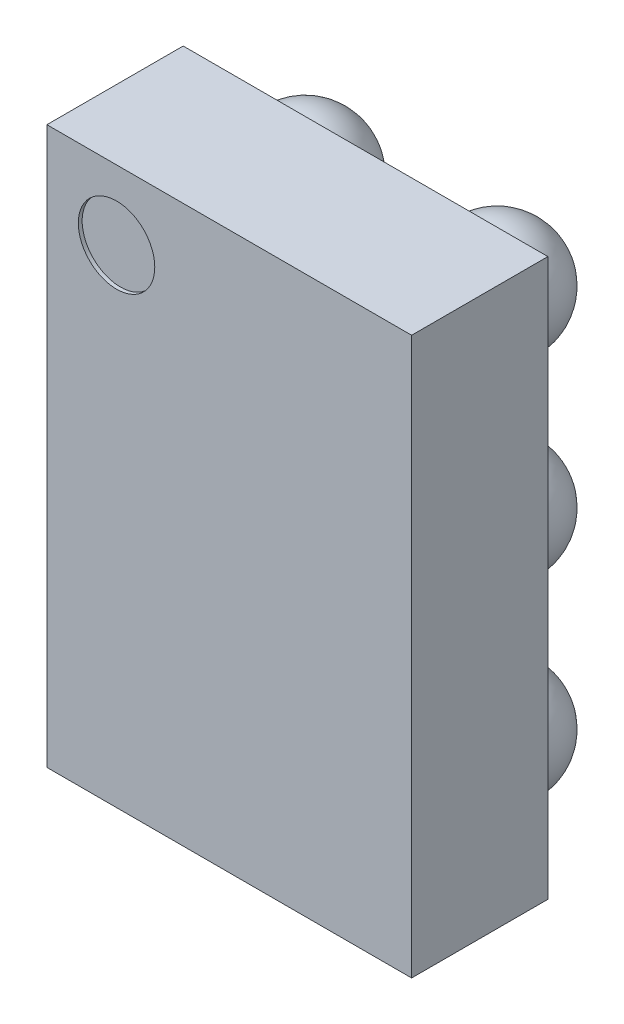
ISO-10303-21;
HEADER;
FILE_DESCRIPTION(('STEP AP214'),'2;1');
FILE_NAME('part.step','',(''),(''),'','','');
FILE_SCHEMA(('AUTOMOTIVE_DESIGN { 1 0 10303 214 1 1 1 1 }'));
ENDSEC;
DATA;
#1=APPLICATION_CONTEXT('core data for automotive mechanical design processes');
#2=APPLICATION_PROTOCOL_DEFINITION('international standard','automotive_design',2000,#1);
#3=PRODUCT_CONTEXT('',#1,'mechanical');
#4=PRODUCT('Part','Part','',(#3));
#5=PRODUCT_RELATED_PRODUCT_CATEGORY('part','',(#4));
#6=PRODUCT_DEFINITION_FORMATION('','',#4);
#7=PRODUCT_DEFINITION_CONTEXT('part definition',#1,'design');
#8=PRODUCT_DEFINITION('design','',#6,#7);
#9=PRODUCT_DEFINITION_SHAPE('','',#8);
#10=(LENGTH_UNIT() NAMED_UNIT(*) SI_UNIT(.MILLI.,.METRE.));
#11=(NAMED_UNIT(*) PLANE_ANGLE_UNIT() SI_UNIT($,.RADIAN.));
#12=(NAMED_UNIT(*) SI_UNIT($,.STERADIAN.) SOLID_ANGLE_UNIT());
#13=UNCERTAINTY_MEASURE_WITH_UNIT(LENGTH_MEASURE(1.E-05),#10,'distance_accuracy_value','');
#14=(GEOMETRIC_REPRESENTATION_CONTEXT(3) GLOBAL_UNCERTAINTY_ASSIGNED_CONTEXT((#13)) GLOBAL_UNIT_ASSIGNED_CONTEXT((#10,
#11,#12)) REPRESENTATION_CONTEXT('',''));
#15=CARTESIAN_POINT('',(0.,0.,0.));
#16=DIRECTION('',(0.,0.,1.));
#17=DIRECTION('',(1.,0.,0.));
#18=AXIS2_PLACEMENT_3D('',#15,#16,#17);
#19=CARTESIAN_POINT('',(0.475,-0.725,0.595));
#20=DIRECTION('',(-1.,0.,0.));
#21=DIRECTION('',(0.,0.,1.));
#22=AXIS2_PLACEMENT_3D('',#19,#20,#21);
#23=PLANE('',#22);
#24=DIRECTION('',(0.,1.,0.));
#25=VECTOR('',#24,1.);
#26=CARTESIAN_POINT('',(0.475,-0.725,0.24));
#27=LINE('',#26,#25);
#28=CARTESIAN_POINT('',(0.475,-0.725,0.24));
#29=VERTEX_POINT('',#28);
#30=CARTESIAN_POINT('',(0.475,0.725,0.24));
#31=VERTEX_POINT('',#30);
#32=EDGE_CURVE('E114',#29,#31,#27,.T.);
#33=ORIENTED_EDGE('',*,*,#32,.T.);
#34=DIRECTION('',(0.,0.,-1.));
#35=VECTOR('',#34,1.);
#36=CARTESIAN_POINT('',(0.475,0.725,0.595));
#37=LINE('',#36,#35);
#38=CARTESIAN_POINT('',(0.475,0.725,0.595));
#39=VERTEX_POINT('',#38);
#40=EDGE_CURVE('E103',#39,#31,#37,.T.);
#41=ORIENTED_EDGE('',*,*,#40,.F.);
#42=DIRECTION('',(0.,1.,0.));
#43=VECTOR('',#42,1.);
#44=CARTESIAN_POINT('',(0.475,-0.725,0.595));
#45=LINE('',#44,#43);
#46=CARTESIAN_POINT('',(0.475,-0.725,0.595));
#47=VERTEX_POINT('',#46);
#48=EDGE_CURVE('E95',#47,#39,#45,.T.);
#49=ORIENTED_EDGE('',*,*,#48,.F.);
#50=DIRECTION('',(0.,0.,-1.));
#51=VECTOR('',#50,1.);
#52=CARTESIAN_POINT('',(0.475,-0.725,0.595));
#53=LINE('',#52,#51);
#54=EDGE_CURVE('E110',#47,#29,#53,.T.);
#55=ORIENTED_EDGE('',*,*,#54,.T.);
#56=EDGE_LOOP('',(#33,#41,#49,#55));
#57=FACE_BOUND('',#56,.T.);
#58=ADVANCED_FACE('F42',(#57),#23,.F.);
#59=CARTESIAN_POINT('',(-0.475,0.725,0.595));
#60=DIRECTION('',(0.,-1.,0.));
#61=DIRECTION('',(0.,0.,-1.));
#62=AXIS2_PLACEMENT_3D('',#59,#60,#61);
#63=PLANE('',#62);
#64=DIRECTION('',(-1.,0.,0.));
#65=VECTOR('',#64,1.);
#66=CARTESIAN_POINT('',(-0.475,0.725,0.24));
#67=LINE('',#66,#65);
#68=CARTESIAN_POINT('',(-0.475,0.725,0.24));
#69=VERTEX_POINT('',#68);
#70=EDGE_CURVE('E101',#31,#69,#67,.T.);
#71=ORIENTED_EDGE('',*,*,#70,.T.);
#72=DIRECTION('',(0.,0.,-1.));
#73=VECTOR('',#72,1.);
#74=CARTESIAN_POINT('',(-0.475,0.725,0.595));
#75=LINE('',#74,#73);
#76=CARTESIAN_POINT('',(-0.475,0.725,0.595));
#77=VERTEX_POINT('',#76);
#78=EDGE_CURVE('E99',#77,#69,#75,.T.);
#79=ORIENTED_EDGE('',*,*,#78,.F.);
#80=DIRECTION('',(-1.,0.,0.));
#81=VECTOR('',#80,1.);
#82=CARTESIAN_POINT('',(-0.475,0.725,0.595));
#83=LINE('',#82,#81);
#84=EDGE_CURVE('E90',#39,#77,#83,.T.);
#85=ORIENTED_EDGE('',*,*,#84,.F.);
#86=ORIENTED_EDGE('',*,*,#40,.T.);
#87=EDGE_LOOP('',(#71,#79,#85,#86));
#88=FACE_BOUND('',#87,.T.);
#89=ADVANCED_FACE('F100',(#88),#63,.F.);
#90=CARTESIAN_POINT('',(-0.475,-0.725,0.595));
#91=DIRECTION('',(1.,0.,0.));
#92=DIRECTION('',(0.,0.,-1.));
#93=AXIS2_PLACEMENT_3D('',#90,#91,#92);
#94=PLANE('',#93);
#95=DIRECTION('',(0.,-1.,0.));
#96=VECTOR('',#95,1.);
#97=CARTESIAN_POINT('',(-0.475,-0.725,0.24));
#98=LINE('',#97,#96);
#99=CARTESIAN_POINT('',(-0.475,-0.725,0.24));
#100=VERTEX_POINT('',#99);
#101=EDGE_CURVE('E76',#69,#100,#98,.T.);
#102=ORIENTED_EDGE('',*,*,#101,.T.);
#103=DIRECTION('',(0.,0.,-1.));
#104=VECTOR('',#103,1.);
#105=CARTESIAN_POINT('',(-0.475,-0.725,0.595));
#106=LINE('',#105,#104);
#107=CARTESIAN_POINT('',(-0.475,-0.725,0.595));
#108=VERTEX_POINT('',#107);
#109=EDGE_CURVE('E104',#108,#100,#106,.T.);
#110=ORIENTED_EDGE('',*,*,#109,.F.);
#111=DIRECTION('',(0.,-1.,0.));
#112=VECTOR('',#111,1.);
#113=CARTESIAN_POINT('',(-0.475,-0.725,0.595));
#114=LINE('',#113,#112);
#115=EDGE_CURVE('E93',#77,#108,#114,.T.);
#116=ORIENTED_EDGE('',*,*,#115,.F.);
#117=ORIENTED_EDGE('',*,*,#78,.T.);
#118=EDGE_LOOP('',(#102,#110,#116,#117));
#119=FACE_BOUND('',#118,.T.);
#120=ADVANCED_FACE('F106',(#119),#94,.F.);
#121=CARTESIAN_POINT('',(-0.475,-0.725,0.595));
#122=DIRECTION('',(0.,1.,0.));
#123=DIRECTION('',(0.,0.,1.));
#124=AXIS2_PLACEMENT_3D('',#121,#122,#123);
#125=PLANE('',#124);
#126=DIRECTION('',(1.,0.,0.));
#127=VECTOR('',#126,1.);
#128=CARTESIAN_POINT('',(-0.475,-0.725,0.24));
#129=LINE('',#128,#127);
#130=EDGE_CURVE('E82',#100,#29,#129,.T.);
#131=ORIENTED_EDGE('',*,*,#130,.T.);
#132=ORIENTED_EDGE('',*,*,#54,.F.);
#133=DIRECTION('',(1.,0.,0.));
#134=VECTOR('',#133,1.);
#135=CARTESIAN_POINT('',(-0.475,-0.725,0.595));
#136=LINE('',#135,#134);
#137=EDGE_CURVE('E59',#108,#47,#136,.T.);
#138=ORIENTED_EDGE('',*,*,#137,.F.);
#139=ORIENTED_EDGE('',*,*,#109,.T.);
#140=EDGE_LOOP('',(#131,#132,#138,#139));
#141=FACE_BOUND('',#140,.T.);
#142=ADVANCED_FACE('F168',(#141),#125,.F.);
#143=CARTESIAN_POINT('',(0.,0.,0.595));
#144=DIRECTION('',(0.,0.,-1.));
#145=DIRECTION('',(-1.,0.,0.));
#146=AXIS2_PLACEMENT_3D('',#143,#144,#145);
#147=PLANE('',#146);
#148=CARTESIAN_POINT('',(-0.29362261669954,0.544065436825616,0.595));
#149=DIRECTION('',(0.,0.,1.));
#150=DIRECTION('',(1.,0.,0.));
#151=AXIS2_PLACEMENT_3D('',#148,#149,#150);
#152=CIRCLE('',#151,0.0995870999191672);
#153=CARTESIAN_POINT('',(-0.194035516780372,0.544065436825616,0.595));
#154=VERTEX_POINT('',#153);
#155=EDGE_CURVE('E322',#154,#154,#152,.T.);
#156=ORIENTED_EDGE('',*,*,#155,.F.);
#157=EDGE_LOOP('',(#156));
#158=FACE_BOUND('',#157,.T.);
#159=ORIENTED_EDGE('',*,*,#48,.T.);
#160=ORIENTED_EDGE('',*,*,#84,.T.);
#161=ORIENTED_EDGE('',*,*,#115,.T.);
#162=ORIENTED_EDGE('',*,*,#137,.T.);
#163=EDGE_LOOP('',(#159,#160,#161,#162));
#164=FACE_BOUND('',#163,.T.);
#165=ADVANCED_FACE('F91',(#158,#164),#147,.F.);
#166=CARTESIAN_POINT('',(0.,0.,0.24));
#167=DIRECTION('',(0.,0.,-1.));
#168=DIRECTION('',(-1.,0.,0.));
#169=AXIS2_PLACEMENT_3D('',#166,#167,#168);
#170=PLANE('',#169);
#171=CARTESIAN_POINT('',(-0.25,-0.5,0.24));
#172=DIRECTION('',(0.,0.,-1.));
#173=DIRECTION('',(-1.,0.,0.));
#174=AXIS2_PLACEMENT_3D('',#171,#172,#173);
#175=CIRCLE('',#174,0.114891252930761);
#176=CARTESIAN_POINT('',(-0.364891252930761,-0.5,0.24));
#177=VERTEX_POINT('',#176);
#178=EDGE_CURVE('E11',#177,#177,#175,.T.);
#179=ORIENTED_EDGE('',*,*,#178,.F.);
#180=EDGE_LOOP('',(#179));
#181=FACE_BOUND('',#180,.T.);
#182=CARTESIAN_POINT('',(0.25,-0.5,0.24));
#183=DIRECTION('',(0.,0.,-1.));
#184=DIRECTION('',(-1.,0.,0.));
#185=AXIS2_PLACEMENT_3D('',#182,#183,#184);
#186=CIRCLE('',#185,0.114891252930761);
#187=CARTESIAN_POINT('',(0.135108747069239,-0.5,0.24));
#188=VERTEX_POINT('',#187);
#189=EDGE_CURVE('E51',#188,#188,#186,.T.);
#190=ORIENTED_EDGE('',*,*,#189,.F.);
#191=EDGE_LOOP('',(#190));
#192=FACE_BOUND('',#191,.T.);
#193=CARTESIAN_POINT('',(-0.25,0.,0.24));
#194=DIRECTION('',(0.,0.,-1.));
#195=DIRECTION('',(-1.,0.,0.));
#196=AXIS2_PLACEMENT_3D('',#193,#194,#195);
#197=CIRCLE('',#196,0.114891252930761);
#198=CARTESIAN_POINT('',(-0.364891252930761,0.,0.24));
#199=VERTEX_POINT('',#198);
#200=EDGE_CURVE('E143',#199,#199,#197,.T.);
#201=ORIENTED_EDGE('',*,*,#200,.F.);
#202=EDGE_LOOP('',(#201));
#203=FACE_BOUND('',#202,.T.);
#204=CARTESIAN_POINT('',(0.25,0.,0.24));
#205=DIRECTION('',(0.,0.,-1.));
#206=DIRECTION('',(-1.,0.,0.));
#207=AXIS2_PLACEMENT_3D('',#204,#205,#206);
#208=CIRCLE('',#207,0.114891252930761);
#209=CARTESIAN_POINT('',(0.135108747069239,0.,0.24));
#210=VERTEX_POINT('',#209);
#211=EDGE_CURVE('E139',#210,#210,#208,.T.);
#212=ORIENTED_EDGE('',*,*,#211,.F.);
#213=EDGE_LOOP('',(#212));
#214=FACE_BOUND('',#213,.T.);
#215=CARTESIAN_POINT('',(-0.25,0.5,0.24));
#216=DIRECTION('',(0.,0.,-1.));
#217=DIRECTION('',(-1.,0.,0.));
#218=AXIS2_PLACEMENT_3D('',#215,#216,#217);
#219=CIRCLE('',#218,0.114891252930761);
#220=CARTESIAN_POINT('',(-0.364891252930761,0.5,0.24));
#221=VERTEX_POINT('',#220);
#222=EDGE_CURVE('E135',#221,#221,#219,.T.);
#223=ORIENTED_EDGE('',*,*,#222,.F.);
#224=EDGE_LOOP('',(#223));
#225=FACE_BOUND('',#224,.T.);
#226=CARTESIAN_POINT('',(0.25,0.5,0.24));
#227=DIRECTION('',(0.,0.,-1.));
#228=DIRECTION('',(-1.,0.,0.));
#229=AXIS2_PLACEMENT_3D('',#226,#227,#228);
#230=CIRCLE('',#229,0.114891252930761);
#231=CARTESIAN_POINT('',(0.135108747069239,0.5,0.24));
#232=VERTEX_POINT('',#231);
#233=EDGE_CURVE('E131',#232,#232,#230,.T.);
#234=ORIENTED_EDGE('',*,*,#233,.F.);
#235=EDGE_LOOP('',(#234));
#236=FACE_BOUND('',#235,.T.);
#237=ORIENTED_EDGE('',*,*,#32,.F.);
#238=ORIENTED_EDGE('',*,*,#130,.F.);
#239=ORIENTED_EDGE('',*,*,#101,.F.);
#240=ORIENTED_EDGE('',*,*,#70,.F.);
#241=EDGE_LOOP('',(#237,#238,#239,#240));
#242=FACE_BOUND('',#241,.T.);
#243=ADVANCED_FACE('F152',(#181,#192,#203,#214,#225,#236,#242),#170,.T.);
#244=CARTESIAN_POINT('',(0.25,0.5,0.1475));
#245=DIRECTION('',(0.,0.,1.));
#246=DIRECTION('',(0.,1.,0.));
#247=AXIS2_PLACEMENT_3D('',#244,#245,#246);
#248=SPHERICAL_SURFACE('',#247,0.1475);
#249=ORIENTED_EDGE('',*,*,#233,.T.);
#250=EDGE_LOOP('',(#249));
#251=FACE_BOUND('',#250,.T.);
#252=ADVANCED_FACE('F155',(#251),#248,.T.);
#253=CARTESIAN_POINT('',(-0.25,0.5,0.1475));
#254=DIRECTION('',(0.,0.,1.));
#255=DIRECTION('',(0.,1.,0.));
#256=AXIS2_PLACEMENT_3D('',#253,#254,#255);
#257=SPHERICAL_SURFACE('',#256,0.1475);
#258=ORIENTED_EDGE('',*,*,#222,.T.);
#259=EDGE_LOOP('',(#258));
#260=FACE_BOUND('',#259,.T.);
#261=ADVANCED_FACE('F204',(#260),#257,.T.);
#262=CARTESIAN_POINT('',(0.25,0.,0.1475));
#263=DIRECTION('',(0.,0.,1.));
#264=DIRECTION('',(0.,1.,0.));
#265=AXIS2_PLACEMENT_3D('',#262,#263,#264);
#266=SPHERICAL_SURFACE('',#265,0.1475);
#267=ORIENTED_EDGE('',*,*,#211,.T.);
#268=EDGE_LOOP('',(#267));
#269=FACE_BOUND('',#268,.T.);
#270=ADVANCED_FACE('F222',(#269),#266,.T.);
#271=CARTESIAN_POINT('',(-0.25,0.,0.1475));
#272=DIRECTION('',(0.,0.,1.));
#273=DIRECTION('',(0.,1.,0.));
#274=AXIS2_PLACEMENT_3D('',#271,#272,#273);
#275=SPHERICAL_SURFACE('',#274,0.1475);
#276=ORIENTED_EDGE('',*,*,#200,.T.);
#277=EDGE_LOOP('',(#276));
#278=FACE_BOUND('',#277,.T.);
#279=ADVANCED_FACE('F233',(#278),#275,.T.);
#280=CARTESIAN_POINT('',(0.25,-0.5,0.1475));
#281=DIRECTION('',(0.,0.,1.));
#282=DIRECTION('',(0.,1.,0.));
#283=AXIS2_PLACEMENT_3D('',#280,#281,#282);
#284=SPHERICAL_SURFACE('',#283,0.1475);
#285=ORIENTED_EDGE('',*,*,#189,.T.);
#286=EDGE_LOOP('',(#285));
#287=FACE_BOUND('',#286,.T.);
#288=ADVANCED_FACE('F150',(#287),#284,.T.);
#289=CARTESIAN_POINT('',(-0.25,-0.5,0.1475));
#290=DIRECTION('',(0.,0.,1.));
#291=DIRECTION('',(0.,1.,0.));
#292=AXIS2_PLACEMENT_3D('',#289,#290,#291);
#293=SPHERICAL_SURFACE('',#292,0.1475);
#294=ORIENTED_EDGE('',*,*,#178,.T.);
#295=EDGE_LOOP('',(#294));
#296=FACE_BOUND('',#295,.T.);
#297=ADVANCED_FACE('F254',(#296),#293,.T.);
#298=CARTESIAN_POINT('',(-0.29362261669954,0.544065436825616,0.585));
#299=DIRECTION('',(0.,0.,1.));
#300=DIRECTION('',(1.,0.,0.));
#301=AXIS2_PLACEMENT_3D('',#298,#299,#300);
#302=CYLINDRICAL_SURFACE('',#301,0.0995870999191672);
#303=CARTESIAN_POINT('',(-0.29362261669954,0.544065436825616,0.585));
#304=DIRECTION('',(0.,0.,1.));
#305=DIRECTION('',(1.,0.,0.));
#306=AXIS2_PLACEMENT_3D('',#303,#304,#305);
#307=CIRCLE('',#306,0.0995870999191672);
#308=CARTESIAN_POINT('',(-0.194035516780372,0.544065436825616,0.585));
#309=VERTEX_POINT('',#308);
#310=EDGE_CURVE('E118',#309,#309,#307,.T.);
#311=ORIENTED_EDGE('',*,*,#310,.F.);
#312=EDGE_LOOP('',(#311));
#313=FACE_BOUND('',#312,.T.);
#314=ORIENTED_EDGE('',*,*,#155,.T.);
#315=EDGE_LOOP('',(#314));
#316=FACE_BOUND('',#315,.T.);
#317=ADVANCED_FACE('F264',(#313,#316),#302,.F.);
#318=CARTESIAN_POINT('',(-0.29362261669954,0.544065436825616,0.585));
#319=DIRECTION('',(0.,0.,1.));
#320=DIRECTION('',(1.,0.,0.));
#321=AXIS2_PLACEMENT_3D('',#318,#319,#320);
#322=PLANE('',#321);
#323=ORIENTED_EDGE('',*,*,#310,.T.);
#324=EDGE_LOOP('',(#323));
#325=FACE_BOUND('',#324,.T.);
#326=ADVANCED_FACE('F281',(#325),#322,.T.);
#327=CLOSED_SHELL('',(#58,#89,#120,#142,#165,#243,#252,#261,#270,#279,#288,#297,#317,#326));
#328=MANIFOLD_SOLID_BREP('B2',#327);
#329=ADVANCED_BREP_SHAPE_REPRESENTATION('',(#18,#328),#14);
#330=SHAPE_DEFINITION_REPRESENTATION(#9,#329);
ENDSEC;
END-ISO-10303-21;
